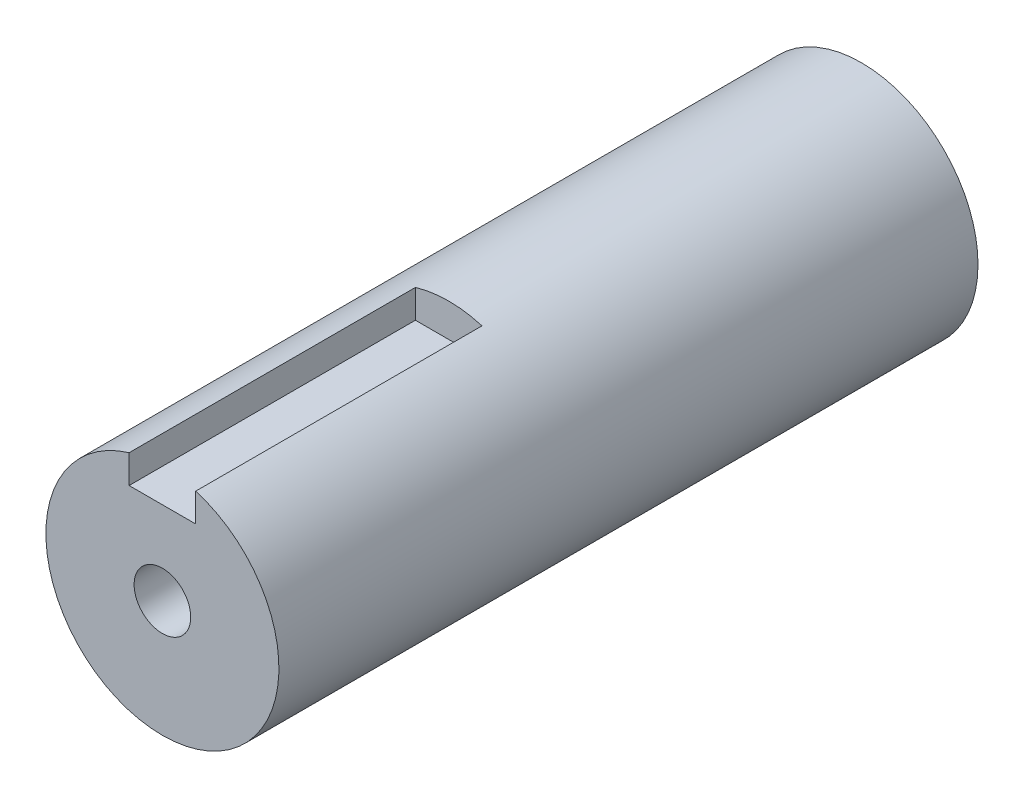
ISO-10303-21;
HEADER;
FILE_DESCRIPTION(('STEP AP214'),'2;1');
FILE_NAME('part.step','',(''),(''),'','','');
FILE_SCHEMA(('AUTOMOTIVE_DESIGN { 1 0 10303 214 1 1 1 1 }'));
ENDSEC;
DATA;
#1=APPLICATION_CONTEXT('core data for automotive mechanical design processes');
#2=APPLICATION_PROTOCOL_DEFINITION('international standard','automotive_design',2000,#1);
#3=PRODUCT_CONTEXT('',#1,'mechanical');
#4=PRODUCT('Part','Part','',(#3));
#5=PRODUCT_RELATED_PRODUCT_CATEGORY('part','',(#4));
#6=PRODUCT_DEFINITION_FORMATION('','',#4);
#7=PRODUCT_DEFINITION_CONTEXT('part definition',#1,'design');
#8=PRODUCT_DEFINITION('design','',#6,#7);
#9=PRODUCT_DEFINITION_SHAPE('','',#8);
#10=(LENGTH_UNIT() NAMED_UNIT(*) SI_UNIT(.MILLI.,.METRE.));
#11=(NAMED_UNIT(*) PLANE_ANGLE_UNIT() SI_UNIT($,.RADIAN.));
#12=(NAMED_UNIT(*) SI_UNIT($,.STERADIAN.) SOLID_ANGLE_UNIT());
#13=UNCERTAINTY_MEASURE_WITH_UNIT(LENGTH_MEASURE(1.E-05),#10,'distance_accuracy_value','');
#14=(GEOMETRIC_REPRESENTATION_CONTEXT(3) GLOBAL_UNCERTAINTY_ASSIGNED_CONTEXT((#13)) GLOBAL_UNIT_ASSIGNED_CONTEXT((#10,
#11,#12)) REPRESENTATION_CONTEXT('',''));
#15=CARTESIAN_POINT('',(0.,0.,0.));
#16=DIRECTION('',(0.,0.,1.));
#17=DIRECTION('',(1.,0.,0.));
#18=AXIS2_PLACEMENT_3D('',#15,#16,#17);
#19=CARTESIAN_POINT('',(0.,0.,105.));
#20=DIRECTION('',(0.,0.,-1.));
#21=DIRECTION('',(-1.,0.,0.));
#22=AXIS2_PLACEMENT_3D('',#19,#20,#21);
#23=CYLINDRICAL_SURFACE('',#22,17.5);
#24=CARTESIAN_POINT('',(0.,0.,105.));
#25=DIRECTION('',(0.,0.,1.));
#26=DIRECTION('',(1.,0.,0.));
#27=AXIS2_PLACEMENT_3D('',#24,#25,#26);
#28=CIRCLE('',#27,17.5);
#29=CARTESIAN_POINT('',(-5.,16.7705098312484,105.));
#30=VERTEX_POINT('',#29);
#31=CARTESIAN_POINT('',(5.,16.7705098312484,105.));
#32=VERTEX_POINT('',#31);
#33=EDGE_CURVE('E115',#30,#32,#28,.T.);
#34=ORIENTED_EDGE('',*,*,#33,.F.);
#35=DIRECTION('',(0.,0.,-1.));
#36=VECTOR('',#35,1.);
#37=CARTESIAN_POINT('',(-5.,16.7705098312484,105.));
#38=LINE('',#37,#36);
#39=CARTESIAN_POINT('',(-5.,16.7705098312484,62.));
#40=VERTEX_POINT('',#39);
#41=EDGE_CURVE('E111',#30,#40,#38,.T.);
#42=ORIENTED_EDGE('',*,*,#41,.T.);
#43=CARTESIAN_POINT('',(0.,0.,62.));
#44=DIRECTION('',(0.,0.,1.));
#45=DIRECTION('',(1.,0.,0.));
#46=AXIS2_PLACEMENT_3D('',#43,#44,#45);
#47=CIRCLE('',#46,17.5);
#48=CARTESIAN_POINT('',(5.,16.7705098312484,62.));
#49=VERTEX_POINT('',#48);
#50=EDGE_CURVE('E11',#49,#40,#47,.T.);
#51=ORIENTED_EDGE('',*,*,#50,.F.);
#52=DIRECTION('',(0.,0.,-1.));
#53=VECTOR('',#52,1.);
#54=CARTESIAN_POINT('',(5.,16.7705098312484,105.));
#55=LINE('',#54,#53);
#56=EDGE_CURVE('E107',#49,#32,#55,.F.);
#57=ORIENTED_EDGE('',*,*,#56,.T.);
#58=EDGE_LOOP('',(#34,#42,#51,#57));
#59=FACE_BOUND('',#58,.T.);
#60=CARTESIAN_POINT('',(0.,0.,0.));
#61=DIRECTION('',(0.,0.,1.));
#62=DIRECTION('',(1.,0.,0.));
#63=AXIS2_PLACEMENT_3D('',#60,#61,#62);
#64=CIRCLE('',#63,17.5);
#65=CARTESIAN_POINT('',(17.5,0.,0.));
#66=VERTEX_POINT('',#65);
#67=EDGE_CURVE('E114',#66,#66,#64,.T.);
#68=ORIENTED_EDGE('',*,*,#67,.T.);
#69=EDGE_LOOP('',(#68));
#70=FACE_BOUND('',#69,.T.);
#71=ADVANCED_FACE('F37',(#59,#70),#23,.T.);
#72=CARTESIAN_POINT('',(0.,0.,105.));
#73=DIRECTION('',(0.,0.,1.));
#74=DIRECTION('',(1.,0.,0.));
#75=AXIS2_PLACEMENT_3D('',#72,#73,#74);
#76=PLANE('',#75);
#77=CARTESIAN_POINT('',(0.,0.,105.));
#78=DIRECTION('',(0.,0.,1.));
#79=DIRECTION('',(1.,0.,0.));
#80=AXIS2_PLACEMENT_3D('',#77,#78,#79);
#81=CIRCLE('',#80,4.24999999999999);
#82=CARTESIAN_POINT('',(4.24999999999999,0.,105.));
#83=VERTEX_POINT('',#82);
#84=EDGE_CURVE('E90',#83,#83,#81,.T.);
#85=ORIENTED_EDGE('',*,*,#84,.F.);
#86=EDGE_LOOP('',(#85));
#87=FACE_BOUND('',#86,.T.);
#88=DIRECTION('',(0.,-1.,0.));
#89=VECTOR('',#88,1.);
#90=CARTESIAN_POINT('',(-5.,0.,105.));
#91=LINE('',#90,#89);
#92=CARTESIAN_POINT('',(-5.,12.5,105.));
#93=VERTEX_POINT('',#92);
#94=EDGE_CURVE('E44',#30,#93,#91,.T.);
#95=ORIENTED_EDGE('',*,*,#94,.F.);
#96=ORIENTED_EDGE('',*,*,#33,.T.);
#97=DIRECTION('',(0.,1.,0.));
#98=VECTOR('',#97,1.);
#99=CARTESIAN_POINT('',(5.,19.5848474201737,105.));
#100=LINE('',#99,#98);
#101=CARTESIAN_POINT('',(5.,12.5,105.));
#102=VERTEX_POINT('',#101);
#103=EDGE_CURVE('E92',#102,#32,#100,.T.);
#104=ORIENTED_EDGE('',*,*,#103,.F.);
#105=DIRECTION('',(1.,0.,0.));
#106=VECTOR('',#105,1.);
#107=CARTESIAN_POINT('',(-5.,12.5,105.));
#108=LINE('',#107,#106);
#109=EDGE_CURVE('E89',#93,#102,#108,.T.);
#110=ORIENTED_EDGE('',*,*,#109,.F.);
#111=EDGE_LOOP('',(#95,#96,#104,#110));
#112=FACE_BOUND('',#111,.T.);
#113=ADVANCED_FACE('F126',(#87,#112),#76,.T.);
#114=CARTESIAN_POINT('',(0.,0.,0.));
#115=DIRECTION('',(0.,0.,1.));
#116=DIRECTION('',(1.,0.,0.));
#117=AXIS2_PLACEMENT_3D('',#114,#115,#116);
#118=PLANE('',#117);
#119=ORIENTED_EDGE('',*,*,#67,.F.);
#120=EDGE_LOOP('',(#119));
#121=FACE_BOUND('',#120,.T.);
#122=ADVANCED_FACE('F136',(#121),#118,.F.);
#123=CARTESIAN_POINT('',(0.,0.,62.));
#124=DIRECTION('',(0.,0.,1.));
#125=DIRECTION('',(1.,0.,0.));
#126=AXIS2_PLACEMENT_3D('',#123,#124,#125);
#127=PLANE('',#126);
#128=ORIENTED_EDGE('',*,*,#50,.T.);
#129=DIRECTION('',(0.,-1.,0.));
#130=VECTOR('',#129,1.);
#131=CARTESIAN_POINT('',(-5.,19.5848474201737,62.));
#132=LINE('',#131,#130);
#133=CARTESIAN_POINT('',(-5.,12.5,62.));
#134=VERTEX_POINT('',#133);
#135=EDGE_CURVE('E97',#40,#134,#132,.T.);
#136=ORIENTED_EDGE('',*,*,#135,.T.);
#137=DIRECTION('',(1.,0.,0.));
#138=VECTOR('',#137,1.);
#139=CARTESIAN_POINT('',(-5.,12.5,62.));
#140=LINE('',#139,#138);
#141=CARTESIAN_POINT('',(5.,12.5,62.));
#142=VERTEX_POINT('',#141);
#143=EDGE_CURVE('E99',#134,#142,#140,.T.);
#144=ORIENTED_EDGE('',*,*,#143,.T.);
#145=DIRECTION('',(0.,1.,0.));
#146=VECTOR('',#145,1.);
#147=CARTESIAN_POINT('',(5.,19.5848474201737,62.));
#148=LINE('',#147,#146);
#149=EDGE_CURVE('E102',#142,#49,#148,.T.);
#150=ORIENTED_EDGE('',*,*,#149,.T.);
#151=EDGE_LOOP('',(#128,#136,#144,#150));
#152=FACE_BOUND('',#151,.T.);
#153=ADVANCED_FACE('F130',(#152),#127,.T.);
#154=CARTESIAN_POINT('',(-5.,19.5848474201737,62.));
#155=DIRECTION('',(-1.,0.,0.));
#156=DIRECTION('',(0.,-1.,0.));
#157=AXIS2_PLACEMENT_3D('',#154,#155,#156);
#158=PLANE('',#157);
#159=ORIENTED_EDGE('',*,*,#94,.T.);
#160=DIRECTION('',(0.,0.,1.));
#161=VECTOR('',#160,1.);
#162=CARTESIAN_POINT('',(-5.,12.5,62.));
#163=LINE('',#162,#161);
#164=EDGE_CURVE('E51',#134,#93,#163,.T.);
#165=ORIENTED_EDGE('',*,*,#164,.F.);
#166=ORIENTED_EDGE('',*,*,#135,.F.);
#167=ORIENTED_EDGE('',*,*,#41,.F.);
#168=EDGE_LOOP('',(#159,#165,#166,#167));
#169=FACE_BOUND('',#168,.T.);
#170=ADVANCED_FACE('F122',(#169),#158,.F.);
#171=CARTESIAN_POINT('',(5.,19.5848474201737,62.));
#172=DIRECTION('',(1.,0.,0.));
#173=DIRECTION('',(0.,1.,0.));
#174=AXIS2_PLACEMENT_3D('',#171,#172,#173);
#175=PLANE('',#174);
#176=ORIENTED_EDGE('',*,*,#149,.F.);
#177=DIRECTION('',(0.,0.,1.));
#178=VECTOR('',#177,1.);
#179=CARTESIAN_POINT('',(5.,12.5,62.));
#180=LINE('',#179,#178);
#181=EDGE_CURVE('E105',#142,#102,#180,.T.);
#182=ORIENTED_EDGE('',*,*,#181,.T.);
#183=ORIENTED_EDGE('',*,*,#103,.T.);
#184=ORIENTED_EDGE('',*,*,#56,.F.);
#185=EDGE_LOOP('',(#176,#182,#183,#184));
#186=FACE_BOUND('',#185,.T.);
#187=ADVANCED_FACE('F129',(#186),#175,.F.);
#188=CARTESIAN_POINT('',(-5.,12.5,62.));
#189=DIRECTION('',(0.,-1.,0.));
#190=DIRECTION('',(0.,0.,-1.));
#191=AXIS2_PLACEMENT_3D('',#188,#189,#190);
#192=PLANE('',#191);
#193=ORIENTED_EDGE('',*,*,#109,.T.);
#194=ORIENTED_EDGE('',*,*,#181,.F.);
#195=ORIENTED_EDGE('',*,*,#143,.F.);
#196=ORIENTED_EDGE('',*,*,#164,.T.);
#197=EDGE_LOOP('',(#193,#194,#195,#196));
#198=FACE_BOUND('',#197,.T.);
#199=ADVANCED_FACE('F83',(#198),#192,.F.);
#200=CARTESIAN_POINT('',(0.,0.,65.));
#201=DIRECTION('',(0.,0.,1.));
#202=DIRECTION('',(1.,0.,0.));
#203=AXIS2_PLACEMENT_3D('',#200,#201,#202);
#204=CONICAL_SURFACE('',#203,4.24999999999999,1.02974425867665);
#205=CARTESIAN_POINT('',(0.,0.,62.4463423691329));
#206=VERTEX_POINT('',#205);
#207=VERTEX_LOOP('',#206);
#208=FACE_BOUND('',#207,.T.);
#209=CARTESIAN_POINT('',(0.,0.,65.));
#210=DIRECTION('',(0.,0.,1.));
#211=DIRECTION('',(1.,0.,0.));
#212=AXIS2_PLACEMENT_3D('',#209,#210,#211);
#213=CIRCLE('',#212,4.24999999999999);
#214=CARTESIAN_POINT('',(4.24999999999999,0.,65.));
#215=VERTEX_POINT('',#214);
#216=EDGE_CURVE('E87',#215,#215,#213,.T.);
#217=ORIENTED_EDGE('',*,*,#216,.T.);
#218=EDGE_LOOP('',(#217));
#219=FACE_BOUND('',#218,.T.);
#220=ADVANCED_FACE('F79',(#208,#219),#204,.F.);
#221=CARTESIAN_POINT('',(0.,0.,105.));
#222=DIRECTION('',(0.,0.,1.));
#223=DIRECTION('',(1.,0.,0.));
#224=AXIS2_PLACEMENT_3D('',#221,#222,#223);
#225=CYLINDRICAL_SURFACE('',#224,4.24999999999999);
#226=ORIENTED_EDGE('',*,*,#216,.F.);
#227=EDGE_LOOP('',(#226));
#228=FACE_BOUND('',#227,.T.);
#229=ORIENTED_EDGE('',*,*,#84,.T.);
#230=EDGE_LOOP('',(#229));
#231=FACE_BOUND('',#230,.T.);
#232=ADVANCED_FACE('F82',(#228,#231),#225,.F.);
#233=CLOSED_SHELL('',(#71,#113,#122,#153,#170,#187,#199,#220,#232));
#234=MANIFOLD_SOLID_BREP('B2',#233);
#235=ADVANCED_BREP_SHAPE_REPRESENTATION('',(#18,#234),#14);
#236=SHAPE_DEFINITION_REPRESENTATION(#9,#235);
ENDSEC;
END-ISO-10303-21;
